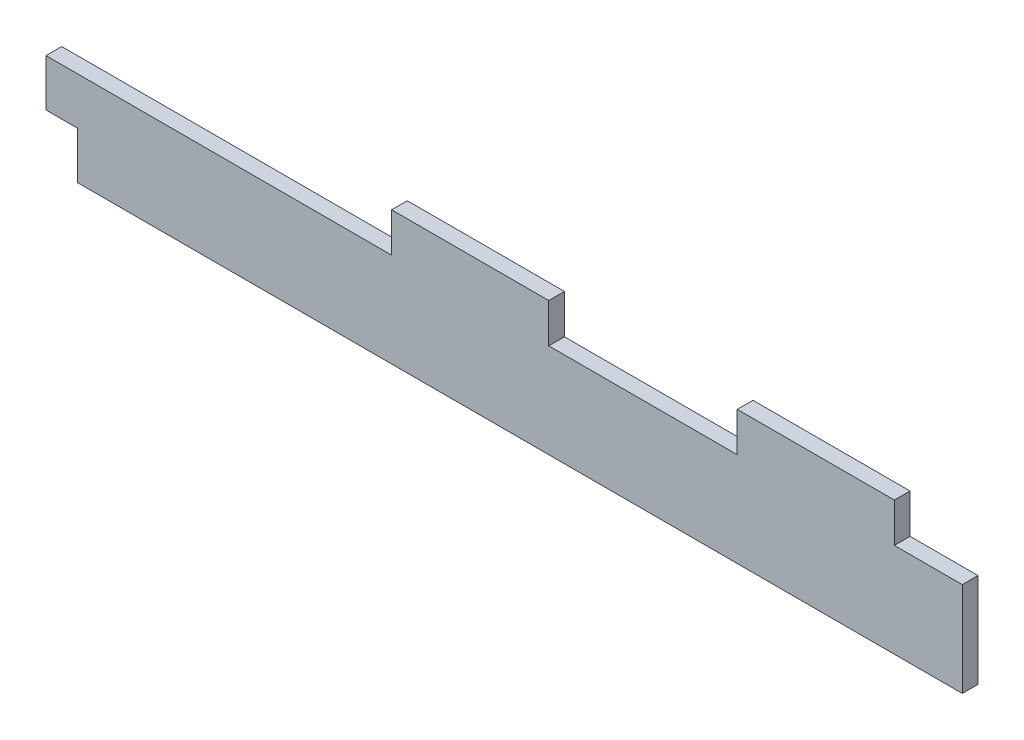
ISO-10303-21;
HEADER;
FILE_DESCRIPTION(('STEP AP214'),'2;1');
FILE_NAME('part.step','',(''),(''),'','','');
FILE_SCHEMA(('AUTOMOTIVE_DESIGN { 1 0 10303 214 1 1 1 1 }'));
ENDSEC;
DATA;
#1=APPLICATION_CONTEXT('core data for automotive mechanical design processes');
#2=APPLICATION_PROTOCOL_DEFINITION('international standard','automotive_design',2000,#1);
#3=PRODUCT_CONTEXT('',#1,'mechanical');
#4=PRODUCT('Part','Part','',(#3));
#5=PRODUCT_RELATED_PRODUCT_CATEGORY('part','',(#4));
#6=PRODUCT_DEFINITION_FORMATION('','',#4);
#7=PRODUCT_DEFINITION_CONTEXT('part definition',#1,'design');
#8=PRODUCT_DEFINITION('design','',#6,#7);
#9=PRODUCT_DEFINITION_SHAPE('','',#8);
#10=(LENGTH_UNIT() NAMED_UNIT(*) SI_UNIT(.MILLI.,.METRE.));
#11=(NAMED_UNIT(*) PLANE_ANGLE_UNIT() SI_UNIT($,.RADIAN.));
#12=(NAMED_UNIT(*) SI_UNIT($,.STERADIAN.) SOLID_ANGLE_UNIT());
#13=UNCERTAINTY_MEASURE_WITH_UNIT(LENGTH_MEASURE(1.E-05),#10,'distance_accuracy_value','');
#14=(GEOMETRIC_REPRESENTATION_CONTEXT(3) GLOBAL_UNCERTAINTY_ASSIGNED_CONTEXT((#13)) GLOBAL_UNIT_ASSIGNED_CONTEXT((#10,
#11,#12)) REPRESENTATION_CONTEXT('',''));
#15=CARTESIAN_POINT('',(0.,0.,0.));
#16=DIRECTION('',(0.,0.,1.));
#17=DIRECTION('',(1.,0.,0.));
#18=AXIS2_PLACEMENT_3D('',#15,#16,#17);
#19=CARTESIAN_POINT('',(93.,15.,-2.));
#20=DIRECTION('',(0.,1.,0.));
#21=DIRECTION('',(0.,0.,1.));
#22=AXIS2_PLACEMENT_3D('',#19,#20,#21);
#23=PLANE('',#22);
#24=DIRECTION('',(-1.,0.,0.));
#25=VECTOR('',#24,1.);
#26=CARTESIAN_POINT('',(93.,15.,0.));
#27=LINE('',#26,#25);
#28=CARTESIAN_POINT('',(101.65,15.,0.));
#29=VERTEX_POINT('',#28);
#30=CARTESIAN_POINT('',(93.,15.,0.));
#31=VERTEX_POINT('',#30);
#32=EDGE_CURVE('E172',#29,#31,#27,.T.);
#33=ORIENTED_EDGE('',*,*,#32,.F.);
#34=DIRECTION('',(0.,0.,1.));
#35=VECTOR('',#34,1.);
#36=CARTESIAN_POINT('',(101.65,15.,-2.));
#37=LINE('',#36,#35);
#38=CARTESIAN_POINT('',(101.65,15.,-2.));
#39=VERTEX_POINT('',#38);
#40=EDGE_CURVE('E11',#39,#29,#37,.T.);
#41=ORIENTED_EDGE('',*,*,#40,.F.);
#42=DIRECTION('',(-1.,0.,0.));
#43=VECTOR('',#42,1.);
#44=CARTESIAN_POINT('',(93.,15.,-2.));
#45=LINE('',#44,#43);
#46=CARTESIAN_POINT('',(93.,15.,-2.));
#47=VERTEX_POINT('',#46);
#48=EDGE_CURVE('E210',#39,#47,#45,.T.);
#49=ORIENTED_EDGE('',*,*,#48,.T.);
#50=DIRECTION('',(0.,0.,1.));
#51=VECTOR('',#50,1.);
#52=CARTESIAN_POINT('',(93.,15.,-2.));
#53=LINE('',#52,#51);
#54=EDGE_CURVE('E42',#47,#31,#53,.T.);
#55=ORIENTED_EDGE('',*,*,#54,.T.);
#56=EDGE_LOOP('',(#33,#41,#49,#55));
#57=FACE_BOUND('',#56,.T.);
#58=ADVANCED_FACE('F39',(#57),#23,.T.);
#59=CARTESIAN_POINT('',(101.65,3.,-2.));
#60=DIRECTION('',(1.,0.,0.));
#61=DIRECTION('',(0.,0.,-1.));
#62=AXIS2_PLACEMENT_3D('',#59,#60,#61);
#63=PLANE('',#62);
#64=DIRECTION('',(0.,1.,0.));
#65=VECTOR('',#64,1.);
#66=CARTESIAN_POINT('',(101.65,3.,0.));
#67=LINE('',#66,#65);
#68=CARTESIAN_POINT('',(101.65,3.,0.));
#69=VERTEX_POINT('',#68);
#70=EDGE_CURVE('E208',#69,#29,#67,.T.);
#71=ORIENTED_EDGE('',*,*,#70,.F.);
#72=DIRECTION('',(0.,0.,1.));
#73=VECTOR('',#72,1.);
#74=CARTESIAN_POINT('',(101.65,3.,-2.));
#75=LINE('',#74,#73);
#76=CARTESIAN_POINT('',(101.65,3.,-2.));
#77=VERTEX_POINT('',#76);
#78=EDGE_CURVE('E48',#77,#69,#75,.T.);
#79=ORIENTED_EDGE('',*,*,#78,.F.);
#80=DIRECTION('',(0.,1.,0.));
#81=VECTOR('',#80,1.);
#82=CARTESIAN_POINT('',(101.65,3.,-2.));
#83=LINE('',#82,#81);
#84=EDGE_CURVE('E162',#77,#39,#83,.T.);
#85=ORIENTED_EDGE('',*,*,#84,.T.);
#86=ORIENTED_EDGE('',*,*,#40,.T.);
#87=EDGE_LOOP('',(#71,#79,#85,#86));
#88=FACE_BOUND('',#87,.T.);
#89=ADVANCED_FACE('F234',(#88),#63,.T.);
#90=CARTESIAN_POINT('',(-11.,3.,-2.));
#91=DIRECTION('',(0.,-1.,0.));
#92=DIRECTION('',(0.,0.,-1.));
#93=AXIS2_PLACEMENT_3D('',#90,#91,#92);
#94=PLANE('',#93);
#95=DIRECTION('',(1.,0.,0.));
#96=VECTOR('',#95,1.);
#97=CARTESIAN_POINT('',(-11.,3.,0.));
#98=LINE('',#97,#96);
#99=CARTESIAN_POINT('',(-11.,3.,0.));
#100=VERTEX_POINT('',#99);
#101=EDGE_CURVE('E149',#100,#69,#98,.T.);
#102=ORIENTED_EDGE('',*,*,#101,.F.);
#103=DIRECTION('',(0.,0.,1.));
#104=VECTOR('',#103,1.);
#105=CARTESIAN_POINT('',(-11.,3.,-2.));
#106=LINE('',#105,#104);
#107=CARTESIAN_POINT('',(-11.,3.,-2.));
#108=VERTEX_POINT('',#107);
#109=EDGE_CURVE('E144',#108,#100,#106,.T.);
#110=ORIENTED_EDGE('',*,*,#109,.F.);
#111=DIRECTION('',(1.,0.,0.));
#112=VECTOR('',#111,1.);
#113=CARTESIAN_POINT('',(-11.,3.,-2.));
#114=LINE('',#113,#112);
#115=EDGE_CURVE('E147',#108,#77,#114,.T.);
#116=ORIENTED_EDGE('',*,*,#115,.T.);
#117=ORIENTED_EDGE('',*,*,#78,.T.);
#118=EDGE_LOOP('',(#102,#110,#116,#117));
#119=FACE_BOUND('',#118,.T.);
#120=ADVANCED_FACE('F146',(#119),#94,.T.);
#121=CARTESIAN_POINT('',(-11.,3.,-2.));
#122=DIRECTION('',(-1.,0.,0.));
#123=DIRECTION('',(0.,0.,1.));
#124=AXIS2_PLACEMENT_3D('',#121,#122,#123);
#125=PLANE('',#124);
#126=DIRECTION('',(0.,-1.,0.));
#127=VECTOR('',#126,1.);
#128=CARTESIAN_POINT('',(-11.,3.,0.));
#129=LINE('',#128,#127);
#130=CARTESIAN_POINT('',(-11.,9.,0.));
#131=VERTEX_POINT('',#130);
#132=EDGE_CURVE('E205',#131,#100,#129,.T.);
#133=ORIENTED_EDGE('',*,*,#132,.F.);
#134=DIRECTION('',(0.,0.,1.));
#135=VECTOR('',#134,1.);
#136=CARTESIAN_POINT('',(-11.,9.,-2.));
#137=LINE('',#136,#135);
#138=CARTESIAN_POINT('',(-11.,9.,-2.));
#139=VERTEX_POINT('',#138);
#140=EDGE_CURVE('E154',#139,#131,#137,.T.);
#141=ORIENTED_EDGE('',*,*,#140,.F.);
#142=DIRECTION('',(0.,-1.,0.));
#143=VECTOR('',#142,1.);
#144=CARTESIAN_POINT('',(-11.,3.,-2.));
#145=LINE('',#144,#143);
#146=EDGE_CURVE('E160',#139,#108,#145,.T.);
#147=ORIENTED_EDGE('',*,*,#146,.T.);
#148=ORIENTED_EDGE('',*,*,#109,.T.);
#149=EDGE_LOOP('',(#133,#141,#147,#148));
#150=FACE_BOUND('',#149,.T.);
#151=ADVANCED_FACE('F164',(#150),#125,.T.);
#152=CARTESIAN_POINT('',(-15.,9.,-2.));
#153=DIRECTION('',(0.,-1.,0.));
#154=DIRECTION('',(0.,0.,-1.));
#155=AXIS2_PLACEMENT_3D('',#152,#153,#154);
#156=PLANE('',#155);
#157=DIRECTION('',(1.,0.,0.));
#158=VECTOR('',#157,1.);
#159=CARTESIAN_POINT('',(-15.,9.,0.));
#160=LINE('',#159,#158);
#161=CARTESIAN_POINT('',(-15.,9.,0.));
#162=VERTEX_POINT('',#161);
#163=EDGE_CURVE('E202',#162,#131,#160,.T.);
#164=ORIENTED_EDGE('',*,*,#163,.F.);
#165=DIRECTION('',(0.,0.,1.));
#166=VECTOR('',#165,1.);
#167=CARTESIAN_POINT('',(-15.,9.,-2.));
#168=LINE('',#167,#166);
#169=CARTESIAN_POINT('',(-15.,9.,-2.));
#170=VERTEX_POINT('',#169);
#171=EDGE_CURVE('E214',#170,#162,#168,.T.);
#172=ORIENTED_EDGE('',*,*,#171,.F.);
#173=DIRECTION('',(1.,0.,0.));
#174=VECTOR('',#173,1.);
#175=CARTESIAN_POINT('',(-15.,9.,-2.));
#176=LINE('',#175,#174);
#177=EDGE_CURVE('E165',#170,#139,#176,.T.);
#178=ORIENTED_EDGE('',*,*,#177,.T.);
#179=ORIENTED_EDGE('',*,*,#140,.T.);
#180=EDGE_LOOP('',(#164,#172,#178,#179));
#181=FACE_BOUND('',#180,.T.);
#182=ADVANCED_FACE('F247',(#181),#156,.T.);
#183=CARTESIAN_POINT('',(-15.,9.,-2.));
#184=DIRECTION('',(-1.,0.,0.));
#185=DIRECTION('',(0.,0.,1.));
#186=AXIS2_PLACEMENT_3D('',#183,#184,#185);
#187=PLANE('',#186);
#188=DIRECTION('',(0.,-1.,0.));
#189=VECTOR('',#188,1.);
#190=CARTESIAN_POINT('',(-15.,9.,0.));
#191=LINE('',#190,#189);
#192=CARTESIAN_POINT('',(-15.,15.,0.));
#193=VERTEX_POINT('',#192);
#194=EDGE_CURVE('E199',#193,#162,#191,.T.);
#195=ORIENTED_EDGE('',*,*,#194,.F.);
#196=DIRECTION('',(0.,0.,1.));
#197=VECTOR('',#196,1.);
#198=CARTESIAN_POINT('',(-15.,15.,-2.));
#199=LINE('',#198,#197);
#200=CARTESIAN_POINT('',(-15.,15.,-2.));
#201=VERTEX_POINT('',#200);
#202=EDGE_CURVE('E216',#201,#193,#199,.T.);
#203=ORIENTED_EDGE('',*,*,#202,.F.);
#204=DIRECTION('',(0.,-1.,0.));
#205=VECTOR('',#204,1.);
#206=CARTESIAN_POINT('',(-15.,9.,-2.));
#207=LINE('',#206,#205);
#208=EDGE_CURVE('E167',#201,#170,#207,.T.);
#209=ORIENTED_EDGE('',*,*,#208,.T.);
#210=ORIENTED_EDGE('',*,*,#171,.T.);
#211=EDGE_LOOP('',(#195,#203,#209,#210));
#212=FACE_BOUND('',#211,.T.);
#213=ADVANCED_FACE('F250',(#212),#187,.T.);
#214=CARTESIAN_POINT('',(-15.,15.,-2.));
#215=DIRECTION('',(0.,1.,0.));
#216=DIRECTION('',(0.,0.,1.));
#217=AXIS2_PLACEMENT_3D('',#214,#215,#216);
#218=PLANE('',#217);
#219=DIRECTION('',(-1.,0.,0.));
#220=VECTOR('',#219,1.);
#221=CARTESIAN_POINT('',(-15.,15.,0.));
#222=LINE('',#221,#220);
#223=CARTESIAN_POINT('',(29.,15.,0.));
#224=VERTEX_POINT('',#223);
#225=EDGE_CURVE('E196',#224,#193,#222,.T.);
#226=ORIENTED_EDGE('',*,*,#225,.F.);
#227=DIRECTION('',(0.,0.,1.));
#228=VECTOR('',#227,1.);
#229=CARTESIAN_POINT('',(29.,15.,-2.));
#230=LINE('',#229,#228);
#231=CARTESIAN_POINT('',(29.,15.,-2.));
#232=VERTEX_POINT('',#231);
#233=EDGE_CURVE('E218',#232,#224,#230,.T.);
#234=ORIENTED_EDGE('',*,*,#233,.F.);
#235=DIRECTION('',(-1.,0.,0.));
#236=VECTOR('',#235,1.);
#237=CARTESIAN_POINT('',(-15.,15.,-2.));
#238=LINE('',#237,#236);
#239=EDGE_CURVE('E439',#232,#201,#238,.T.);
#240=ORIENTED_EDGE('',*,*,#239,.T.);
#241=ORIENTED_EDGE('',*,*,#202,.T.);
#242=EDGE_LOOP('',(#226,#234,#240,#241));
#243=FACE_BOUND('',#242,.T.);
#244=ADVANCED_FACE('F254',(#243),#218,.T.);
#245=CARTESIAN_POINT('',(29.,15.,-2.));
#246=DIRECTION('',(-1.,0.,0.));
#247=DIRECTION('',(0.,0.,1.));
#248=AXIS2_PLACEMENT_3D('',#245,#246,#247);
#249=PLANE('',#248);
#250=DIRECTION('',(0.,-1.,0.));
#251=VECTOR('',#250,1.);
#252=CARTESIAN_POINT('',(29.,15.,0.));
#253=LINE('',#252,#251);
#254=CARTESIAN_POINT('',(29.,20.,0.));
#255=VERTEX_POINT('',#254);
#256=EDGE_CURVE('E193',#255,#224,#253,.T.);
#257=ORIENTED_EDGE('',*,*,#256,.F.);
#258=DIRECTION('',(0.,0.,1.));
#259=VECTOR('',#258,1.);
#260=CARTESIAN_POINT('',(29.,20.,-2.));
#261=LINE('',#260,#259);
#262=CARTESIAN_POINT('',(29.,20.,-2.));
#263=VERTEX_POINT('',#262);
#264=EDGE_CURVE('E220',#263,#255,#261,.T.);
#265=ORIENTED_EDGE('',*,*,#264,.F.);
#266=DIRECTION('',(0.,-1.,0.));
#267=VECTOR('',#266,1.);
#268=CARTESIAN_POINT('',(29.,15.,-2.));
#269=LINE('',#268,#267);
#270=EDGE_CURVE('E432',#263,#232,#269,.T.);
#271=ORIENTED_EDGE('',*,*,#270,.T.);
#272=ORIENTED_EDGE('',*,*,#233,.T.);
#273=EDGE_LOOP('',(#257,#265,#271,#272));
#274=FACE_BOUND('',#273,.T.);
#275=ADVANCED_FACE('F258',(#274),#249,.T.);
#276=CARTESIAN_POINT('',(29.,20.,-2.));
#277=DIRECTION('',(0.,1.,0.));
#278=DIRECTION('',(0.,0.,1.));
#279=AXIS2_PLACEMENT_3D('',#276,#277,#278);
#280=PLANE('',#279);
#281=DIRECTION('',(-1.,0.,0.));
#282=VECTOR('',#281,1.);
#283=CARTESIAN_POINT('',(29.,20.,0.));
#284=LINE('',#283,#282);
#285=CARTESIAN_POINT('',(49.,20.,0.));
#286=VERTEX_POINT('',#285);
#287=EDGE_CURVE('E190',#286,#255,#284,.T.);
#288=ORIENTED_EDGE('',*,*,#287,.F.);
#289=DIRECTION('',(0.,0.,1.));
#290=VECTOR('',#289,1.);
#291=CARTESIAN_POINT('',(49.,20.,-2.));
#292=LINE('',#291,#290);
#293=CARTESIAN_POINT('',(49.,20.,-2.));
#294=VERTEX_POINT('',#293);
#295=EDGE_CURVE('E222',#294,#286,#292,.T.);
#296=ORIENTED_EDGE('',*,*,#295,.F.);
#297=DIRECTION('',(-1.,0.,0.));
#298=VECTOR('',#297,1.);
#299=CARTESIAN_POINT('',(29.,20.,-2.));
#300=LINE('',#299,#298);
#301=EDGE_CURVE('E428',#294,#263,#300,.T.);
#302=ORIENTED_EDGE('',*,*,#301,.T.);
#303=ORIENTED_EDGE('',*,*,#264,.T.);
#304=EDGE_LOOP('',(#288,#296,#302,#303));
#305=FACE_BOUND('',#304,.T.);
#306=ADVANCED_FACE('F262',(#305),#280,.T.);
#307=CARTESIAN_POINT('',(49.,15.,-2.));
#308=DIRECTION('',(1.,0.,0.));
#309=DIRECTION('',(0.,0.,-1.));
#310=AXIS2_PLACEMENT_3D('',#307,#308,#309);
#311=PLANE('',#310);
#312=DIRECTION('',(0.,1.,0.));
#313=VECTOR('',#312,1.);
#314=CARTESIAN_POINT('',(49.,15.,0.));
#315=LINE('',#314,#313);
#316=CARTESIAN_POINT('',(49.,15.,0.));
#317=VERTEX_POINT('',#316);
#318=EDGE_CURVE('E187',#317,#286,#315,.T.);
#319=ORIENTED_EDGE('',*,*,#318,.F.);
#320=DIRECTION('',(0.,0.,1.));
#321=VECTOR('',#320,1.);
#322=CARTESIAN_POINT('',(49.,15.,-2.));
#323=LINE('',#322,#321);
#324=CARTESIAN_POINT('',(49.,15.,-2.));
#325=VERTEX_POINT('',#324);
#326=EDGE_CURVE('E224',#325,#317,#323,.T.);
#327=ORIENTED_EDGE('',*,*,#326,.F.);
#328=DIRECTION('',(0.,1.,0.));
#329=VECTOR('',#328,1.);
#330=CARTESIAN_POINT('',(49.,15.,-2.));
#331=LINE('',#330,#329);
#332=EDGE_CURVE('E444',#325,#294,#331,.T.);
#333=ORIENTED_EDGE('',*,*,#332,.T.);
#334=ORIENTED_EDGE('',*,*,#295,.T.);
#335=EDGE_LOOP('',(#319,#327,#333,#334));
#336=FACE_BOUND('',#335,.T.);
#337=ADVANCED_FACE('F266',(#336),#311,.T.);
#338=CARTESIAN_POINT('',(49.,15.,-2.));
#339=DIRECTION('',(0.,1.,0.));
#340=DIRECTION('',(0.,0.,1.));
#341=AXIS2_PLACEMENT_3D('',#338,#339,#340);
#342=PLANE('',#341);
#343=DIRECTION('',(-1.,0.,0.));
#344=VECTOR('',#343,1.);
#345=CARTESIAN_POINT('',(49.,15.,0.));
#346=LINE('',#345,#344);
#347=CARTESIAN_POINT('',(73.,15.,0.));
#348=VERTEX_POINT('',#347);
#349=EDGE_CURVE('E184',#348,#317,#346,.T.);
#350=ORIENTED_EDGE('',*,*,#349,.F.);
#351=DIRECTION('',(0.,0.,1.));
#352=VECTOR('',#351,1.);
#353=CARTESIAN_POINT('',(73.,15.,-2.));
#354=LINE('',#353,#352);
#355=CARTESIAN_POINT('',(73.,15.,-2.));
#356=VERTEX_POINT('',#355);
#357=EDGE_CURVE('E226',#356,#348,#354,.T.);
#358=ORIENTED_EDGE('',*,*,#357,.F.);
#359=DIRECTION('',(-1.,0.,0.));
#360=VECTOR('',#359,1.);
#361=CARTESIAN_POINT('',(49.,15.,-2.));
#362=LINE('',#361,#360);
#363=EDGE_CURVE('E421',#356,#325,#362,.T.);
#364=ORIENTED_EDGE('',*,*,#363,.T.);
#365=ORIENTED_EDGE('',*,*,#326,.T.);
#366=EDGE_LOOP('',(#350,#358,#364,#365));
#367=FACE_BOUND('',#366,.T.);
#368=ADVANCED_FACE('F270',(#367),#342,.T.);
#369=CARTESIAN_POINT('',(73.,15.,-2.));
#370=DIRECTION('',(-1.,0.,0.));
#371=DIRECTION('',(0.,0.,1.));
#372=AXIS2_PLACEMENT_3D('',#369,#370,#371);
#373=PLANE('',#372);
#374=DIRECTION('',(0.,-1.,0.));
#375=VECTOR('',#374,1.);
#376=CARTESIAN_POINT('',(73.,15.,0.));
#377=LINE('',#376,#375);
#378=CARTESIAN_POINT('',(73.,20.,0.));
#379=VERTEX_POINT('',#378);
#380=EDGE_CURVE('E181',#379,#348,#377,.T.);
#381=ORIENTED_EDGE('',*,*,#380,.F.);
#382=DIRECTION('',(0.,0.,1.));
#383=VECTOR('',#382,1.);
#384=CARTESIAN_POINT('',(73.,20.,-2.));
#385=LINE('',#384,#383);
#386=CARTESIAN_POINT('',(73.,20.,-2.));
#387=VERTEX_POINT('',#386);
#388=EDGE_CURVE('E228',#387,#379,#385,.T.);
#389=ORIENTED_EDGE('',*,*,#388,.F.);
#390=DIRECTION('',(0.,-1.,0.));
#391=VECTOR('',#390,1.);
#392=CARTESIAN_POINT('',(73.,15.,-2.));
#393=LINE('',#392,#391);
#394=EDGE_CURVE('E417',#387,#356,#393,.T.);
#395=ORIENTED_EDGE('',*,*,#394,.T.);
#396=ORIENTED_EDGE('',*,*,#357,.T.);
#397=EDGE_LOOP('',(#381,#389,#395,#396));
#398=FACE_BOUND('',#397,.T.);
#399=ADVANCED_FACE('F274',(#398),#373,.T.);
#400=CARTESIAN_POINT('',(73.,20.,-2.));
#401=DIRECTION('',(0.,1.,0.));
#402=DIRECTION('',(0.,0.,1.));
#403=AXIS2_PLACEMENT_3D('',#400,#401,#402);
#404=PLANE('',#403);
#405=DIRECTION('',(-1.,0.,0.));
#406=VECTOR('',#405,1.);
#407=CARTESIAN_POINT('',(73.,20.,0.));
#408=LINE('',#407,#406);
#409=CARTESIAN_POINT('',(93.,20.,0.));
#410=VERTEX_POINT('',#409);
#411=EDGE_CURVE('E178',#410,#379,#408,.T.);
#412=ORIENTED_EDGE('',*,*,#411,.F.);
#413=DIRECTION('',(0.,0.,1.));
#414=VECTOR('',#413,1.);
#415=CARTESIAN_POINT('',(93.,20.,-2.));
#416=LINE('',#415,#414);
#417=CARTESIAN_POINT('',(93.,20.,-2.));
#418=VERTEX_POINT('',#417);
#419=EDGE_CURVE('E229',#418,#410,#416,.T.);
#420=ORIENTED_EDGE('',*,*,#419,.F.);
#421=DIRECTION('',(-1.,0.,0.));
#422=VECTOR('',#421,1.);
#423=CARTESIAN_POINT('',(73.,20.,-2.));
#424=LINE('',#423,#422);
#425=EDGE_CURVE('E448',#418,#387,#424,.T.);
#426=ORIENTED_EDGE('',*,*,#425,.T.);
#427=ORIENTED_EDGE('',*,*,#388,.T.);
#428=EDGE_LOOP('',(#412,#420,#426,#427));
#429=FACE_BOUND('',#428,.T.);
#430=ADVANCED_FACE('F278',(#429),#404,.T.);
#431=CARTESIAN_POINT('',(93.,15.,-2.));
#432=DIRECTION('',(1.,0.,0.));
#433=DIRECTION('',(0.,0.,-1.));
#434=AXIS2_PLACEMENT_3D('',#431,#432,#433);
#435=PLANE('',#434);
#436=DIRECTION('',(0.,1.,0.));
#437=VECTOR('',#436,1.);
#438=CARTESIAN_POINT('',(93.,15.,0.));
#439=LINE('',#438,#437);
#440=EDGE_CURVE('E175',#31,#410,#439,.T.);
#441=ORIENTED_EDGE('',*,*,#440,.F.);
#442=ORIENTED_EDGE('',*,*,#54,.F.);
#443=DIRECTION('',(0.,1.,0.));
#444=VECTOR('',#443,1.);
#445=CARTESIAN_POINT('',(93.,15.,-2.));
#446=LINE('',#445,#444);
#447=EDGE_CURVE('E450',#47,#418,#446,.T.);
#448=ORIENTED_EDGE('',*,*,#447,.T.);
#449=ORIENTED_EDGE('',*,*,#419,.T.);
#450=EDGE_LOOP('',(#441,#442,#448,#449));
#451=FACE_BOUND('',#450,.T.);
#452=ADVANCED_FACE('F231',(#451),#435,.T.);
#453=CARTESIAN_POINT('',(0.,0.,-2.));
#454=DIRECTION('',(0.,0.,1.));
#455=DIRECTION('',(1.,0.,0.));
#456=AXIS2_PLACEMENT_3D('',#453,#454,#455);
#457=PLANE('',#456);
#458=ORIENTED_EDGE('',*,*,#48,.F.);
#459=ORIENTED_EDGE('',*,*,#84,.F.);
#460=ORIENTED_EDGE('',*,*,#115,.F.);
#461=ORIENTED_EDGE('',*,*,#146,.F.);
#462=ORIENTED_EDGE('',*,*,#177,.F.);
#463=ORIENTED_EDGE('',*,*,#208,.F.);
#464=ORIENTED_EDGE('',*,*,#239,.F.);
#465=ORIENTED_EDGE('',*,*,#270,.F.);
#466=ORIENTED_EDGE('',*,*,#301,.F.);
#467=ORIENTED_EDGE('',*,*,#332,.F.);
#468=ORIENTED_EDGE('',*,*,#363,.F.);
#469=ORIENTED_EDGE('',*,*,#394,.F.);
#470=ORIENTED_EDGE('',*,*,#425,.F.);
#471=ORIENTED_EDGE('',*,*,#447,.F.);
#472=EDGE_LOOP('',(#458,#459,#460,#461,#462,#463,#464,#465,#466,#467,#468,#469,#470,#471));
#473=FACE_BOUND('',#472,.T.);
#474=ADVANCED_FACE('F158',(#473),#457,.F.);
#475=CARTESIAN_POINT('',(0.,0.,0.));
#476=DIRECTION('',(0.,0.,1.));
#477=DIRECTION('',(1.,0.,0.));
#478=AXIS2_PLACEMENT_3D('',#475,#476,#477);
#479=PLANE('',#478);
#480=ORIENTED_EDGE('',*,*,#32,.T.);
#481=ORIENTED_EDGE('',*,*,#440,.T.);
#482=ORIENTED_EDGE('',*,*,#411,.T.);
#483=ORIENTED_EDGE('',*,*,#380,.T.);
#484=ORIENTED_EDGE('',*,*,#349,.T.);
#485=ORIENTED_EDGE('',*,*,#318,.T.);
#486=ORIENTED_EDGE('',*,*,#287,.T.);
#487=ORIENTED_EDGE('',*,*,#256,.T.);
#488=ORIENTED_EDGE('',*,*,#225,.T.);
#489=ORIENTED_EDGE('',*,*,#194,.T.);
#490=ORIENTED_EDGE('',*,*,#163,.T.);
#491=ORIENTED_EDGE('',*,*,#132,.T.);
#492=ORIENTED_EDGE('',*,*,#101,.T.);
#493=ORIENTED_EDGE('',*,*,#70,.T.);
#494=EDGE_LOOP('',(#480,#481,#482,#483,#484,#485,#486,#487,#488,#489,#490,#491,#492,#493));
#495=FACE_BOUND('',#494,.T.);
#496=ADVANCED_FACE('F233',(#495),#479,.T.);
#497=CLOSED_SHELL('',(#58,#89,#120,#151,#182,#213,#244,#275,#306,#337,#368,#399,#430,#452,#474,#496));
#498=MANIFOLD_SOLID_BREP('B2',#497);
#499=ADVANCED_BREP_SHAPE_REPRESENTATION('',(#18,#498),#14);
#500=SHAPE_DEFINITION_REPRESENTATION(#9,#499);
ENDSEC;
END-ISO-10303-21;
